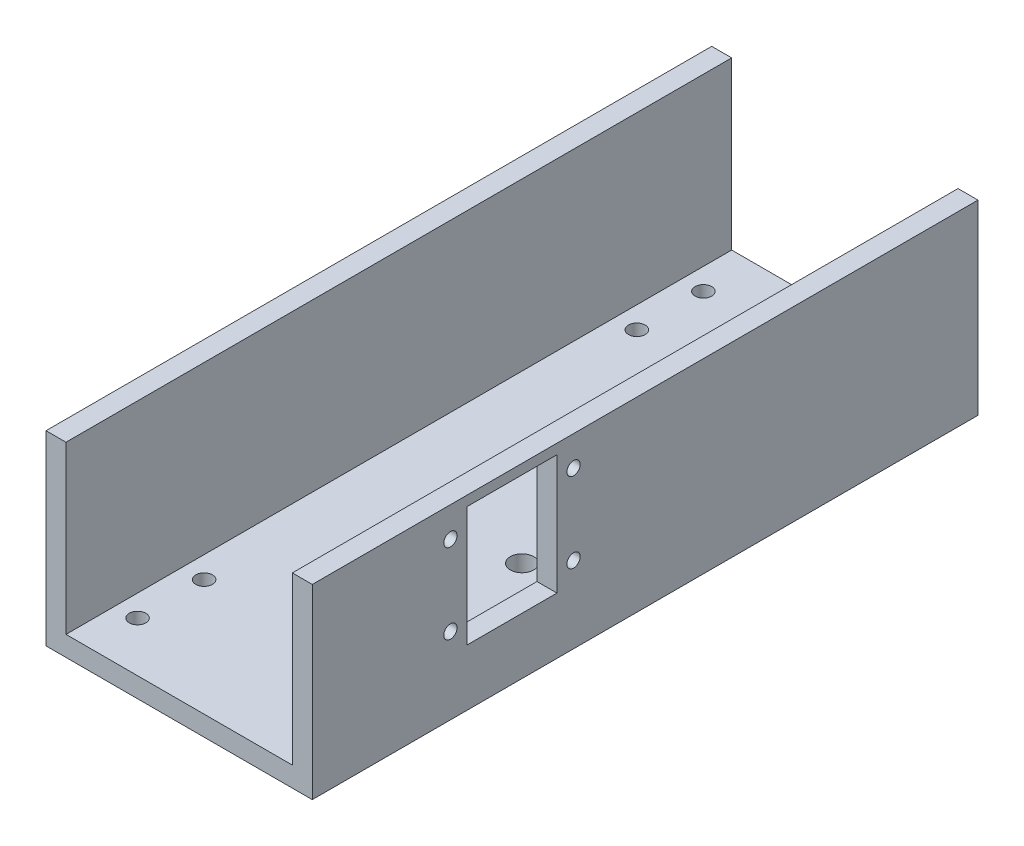
ISO-10303-21;
HEADER;
FILE_DESCRIPTION(('STEP AP214'),'2;1');
FILE_NAME('part.step','',(''),(''),'','','');
FILE_SCHEMA(('AUTOMOTIVE_DESIGN { 1 0 10303 214 1 1 1 1 }'));
ENDSEC;
DATA;
#1=APPLICATION_CONTEXT('core data for automotive mechanical design processes');
#2=APPLICATION_PROTOCOL_DEFINITION('international standard','automotive_design',2000,#1);
#3=PRODUCT_CONTEXT('',#1,'mechanical');
#4=PRODUCT('Part','Part','',(#3));
#5=PRODUCT_RELATED_PRODUCT_CATEGORY('part','',(#4));
#6=PRODUCT_DEFINITION_FORMATION('','',#4);
#7=PRODUCT_DEFINITION_CONTEXT('part definition',#1,'design');
#8=PRODUCT_DEFINITION('design','',#6,#7);
#9=PRODUCT_DEFINITION_SHAPE('','',#8);
#10=(LENGTH_UNIT() NAMED_UNIT(*) SI_UNIT(.MILLI.,.METRE.));
#11=(NAMED_UNIT(*) PLANE_ANGLE_UNIT() SI_UNIT($,.RADIAN.));
#12=(NAMED_UNIT(*) SI_UNIT($,.STERADIAN.) SOLID_ANGLE_UNIT());
#13=UNCERTAINTY_MEASURE_WITH_UNIT(LENGTH_MEASURE(1.E-05),#10,'distance_accuracy_value','');
#14=(GEOMETRIC_REPRESENTATION_CONTEXT(3) GLOBAL_UNCERTAINTY_ASSIGNED_CONTEXT((#13)) GLOBAL_UNIT_ASSIGNED_CONTEXT((#10,
#11,#12)) REPRESENTATION_CONTEXT('',''));
#15=CARTESIAN_POINT('',(0.,0.,0.));
#16=DIRECTION('',(0.,0.,1.));
#17=DIRECTION('',(1.,0.,0.));
#18=AXIS2_PLACEMENT_3D('',#15,#16,#17);
#19=CARTESIAN_POINT('',(40.,56.,200.));
#20=DIRECTION('',(0.,-1.,0.));
#21=DIRECTION('',(0.,0.,-1.));
#22=AXIS2_PLACEMENT_3D('',#19,#20,#21);
#23=PLANE('',#22);
#24=DIRECTION('',(-1.,0.,0.));
#25=VECTOR('',#24,1.);
#26=CARTESIAN_POINT('',(40.,56.,0.));
#27=LINE('',#26,#25);
#28=CARTESIAN_POINT('',(40.,56.,0.));
#29=VERTEX_POINT('',#28);
#30=CARTESIAN_POINT('',(34.,56.,0.));
#31=VERTEX_POINT('',#30);
#32=EDGE_CURVE('E204',#29,#31,#27,.T.);
#33=ORIENTED_EDGE('',*,*,#32,.T.);
#34=DIRECTION('',(0.,0.,-1.));
#35=VECTOR('',#34,1.);
#36=CARTESIAN_POINT('',(34.,56.,200.));
#37=LINE('',#36,#35);
#38=CARTESIAN_POINT('',(34.,56.,200.));
#39=VERTEX_POINT('',#38);
#40=EDGE_CURVE('E11',#39,#31,#37,.T.);
#41=ORIENTED_EDGE('',*,*,#40,.F.);
#42=DIRECTION('',(-1.,0.,0.));
#43=VECTOR('',#42,1.);
#44=CARTESIAN_POINT('',(40.,56.,200.));
#45=LINE('',#44,#43);
#46=CARTESIAN_POINT('',(40.,56.,200.));
#47=VERTEX_POINT('',#46);
#48=EDGE_CURVE('E205',#47,#39,#45,.T.);
#49=ORIENTED_EDGE('',*,*,#48,.F.);
#50=DIRECTION('',(0.,0.,-1.));
#51=VECTOR('',#50,1.);
#52=CARTESIAN_POINT('',(40.,56.,200.));
#53=LINE('',#52,#51);
#54=EDGE_CURVE('E223',#47,#29,#53,.T.);
#55=ORIENTED_EDGE('',*,*,#54,.T.);
#56=EDGE_LOOP('',(#33,#41,#49,#55));
#57=FACE_BOUND('',#56,.T.);
#58=ADVANCED_FACE('F35',(#57),#23,.F.);
#59=CARTESIAN_POINT('',(34.,56.,200.));
#60=DIRECTION('',(1.,0.,0.));
#61=DIRECTION('',(0.,1.,0.));
#62=AXIS2_PLACEMENT_3D('',#59,#60,#61);
#63=PLANE('',#62);
#64=CARTESIAN_POINT('',(34.,23.0000000004471,158.5));
#65=DIRECTION('',(1.,0.,0.));
#66=DIRECTION('',(0.,1.,0.));
#67=AXIS2_PLACEMENT_3D('',#64,#65,#66);
#68=CIRCLE('',#67,2.);
#69=CARTESIAN_POINT('',(34.,25.0000000004471,158.5));
#70=VERTEX_POINT('',#69);
#71=EDGE_CURVE('E264',#70,#70,#68,.T.);
#72=ORIENTED_EDGE('',*,*,#71,.T.);
#73=EDGE_LOOP('',(#72));
#74=FACE_BOUND('',#73,.T.);
#75=CARTESIAN_POINT('',(34.,47.0000000004471,158.5));
#76=DIRECTION('',(1.,0.,0.));
#77=DIRECTION('',(0.,1.,0.));
#78=AXIS2_PLACEMENT_3D('',#75,#76,#77);
#79=CIRCLE('',#78,1.99999999998778);
#80=CARTESIAN_POINT('',(34.,49.0000000004349,158.5));
#81=VERTEX_POINT('',#80);
#82=EDGE_CURVE('E279',#81,#81,#79,.T.);
#83=ORIENTED_EDGE('',*,*,#82,.T.);
#84=EDGE_LOOP('',(#83));
#85=FACE_BOUND('',#84,.T.);
#86=CARTESIAN_POINT('',(34.,47.0000000004471,121.5));
#87=DIRECTION('',(1.,0.,0.));
#88=DIRECTION('',(0.,1.,0.));
#89=AXIS2_PLACEMENT_3D('',#86,#87,#88);
#90=CIRCLE('',#89,1.99999999998778);
#91=CARTESIAN_POINT('',(34.,49.0000000004349,121.5));
#92=VERTEX_POINT('',#91);
#93=EDGE_CURVE('E285',#92,#92,#90,.T.);
#94=ORIENTED_EDGE('',*,*,#93,.T.);
#95=EDGE_LOOP('',(#94));
#96=FACE_BOUND('',#95,.T.);
#97=CARTESIAN_POINT('',(34.,23.0000000004471,121.5));
#98=DIRECTION('',(1.,0.,0.));
#99=DIRECTION('',(0.,1.,0.));
#100=AXIS2_PLACEMENT_3D('',#97,#98,#99);
#101=CIRCLE('',#100,2.);
#102=CARTESIAN_POINT('',(34.,25.0000000004471,121.5));
#103=VERTEX_POINT('',#102);
#104=EDGE_CURVE('E291',#103,#103,#101,.T.);
#105=ORIENTED_EDGE('',*,*,#104,.T.);
#106=EDGE_LOOP('',(#105));
#107=FACE_BOUND('',#106,.T.);
#108=DIRECTION('',(0.,0.,-1.));
#109=VECTOR('',#108,1.);
#110=CARTESIAN_POINT('',(34.,17.0000000004471,200.));
#111=LINE('',#110,#109);
#112=CARTESIAN_POINT('',(34.,17.0000000004471,153.5));
#113=VERTEX_POINT('',#112);
#114=CARTESIAN_POINT('',(34.,17.0000000004471,126.5));
#115=VERTEX_POINT('',#114);
#116=EDGE_CURVE('E156',#113,#115,#111,.T.);
#117=ORIENTED_EDGE('',*,*,#116,.T.);
#118=DIRECTION('',(0.,1.,0.));
#119=VECTOR('',#118,1.);
#120=CARTESIAN_POINT('',(34.,56.,126.5));
#121=LINE('',#120,#119);
#122=CARTESIAN_POINT('',(34.,53.0000000004471,126.5));
#123=VERTEX_POINT('',#122);
#124=EDGE_CURVE('E159',#115,#123,#121,.T.);
#125=ORIENTED_EDGE('',*,*,#124,.T.);
#126=DIRECTION('',(0.,0.,1.));
#127=VECTOR('',#126,1.);
#128=CARTESIAN_POINT('',(34.,53.0000000004471,200.));
#129=LINE('',#128,#127);
#130=CARTESIAN_POINT('',(34.,53.0000000004471,153.5));
#131=VERTEX_POINT('',#130);
#132=EDGE_CURVE('E151',#123,#131,#129,.T.);
#133=ORIENTED_EDGE('',*,*,#132,.T.);
#134=DIRECTION('',(0.,-1.,0.));
#135=VECTOR('',#134,1.);
#136=CARTESIAN_POINT('',(34.,56.,153.5));
#137=LINE('',#136,#135);
#138=EDGE_CURVE('E131',#131,#113,#137,.T.);
#139=ORIENTED_EDGE('',*,*,#138,.T.);
#140=EDGE_LOOP('',(#117,#125,#133,#139));
#141=FACE_BOUND('',#140,.T.);
#142=DIRECTION('',(0.,-1.,0.));
#143=VECTOR('',#142,1.);
#144=CARTESIAN_POINT('',(34.,56.,0.));
#145=LINE('',#144,#143);
#146=CARTESIAN_POINT('',(34.,5.99999999999999,0.));
#147=VERTEX_POINT('',#146);
#148=EDGE_CURVE('E226',#31,#147,#145,.T.);
#149=ORIENTED_EDGE('',*,*,#148,.T.);
#150=DIRECTION('',(0.,0.,-1.));
#151=VECTOR('',#150,1.);
#152=CARTESIAN_POINT('',(34.,5.99999999999999,200.));
#153=LINE('',#152,#151);
#154=CARTESIAN_POINT('',(34.,5.99999999999999,200.));
#155=VERTEX_POINT('',#154);
#156=EDGE_CURVE('E43',#155,#147,#153,.T.);
#157=ORIENTED_EDGE('',*,*,#156,.F.);
#158=DIRECTION('',(0.,-1.,0.));
#159=VECTOR('',#158,1.);
#160=CARTESIAN_POINT('',(34.,56.,200.));
#161=LINE('',#160,#159);
#162=EDGE_CURVE('E208',#39,#155,#161,.T.);
#163=ORIENTED_EDGE('',*,*,#162,.F.);
#164=ORIENTED_EDGE('',*,*,#40,.T.);
#165=EDGE_LOOP('',(#149,#157,#163,#164));
#166=FACE_BOUND('',#165,.T.);
#167=ADVANCED_FACE('F295',(#74,#85,#96,#107,#141,#166),#63,.F.);
#168=CARTESIAN_POINT('',(34.,5.99999999999999,200.));
#169=DIRECTION('',(0.,-1.,0.));
#170=DIRECTION('',(0.,0.,-1.));
#171=AXIS2_PLACEMENT_3D('',#168,#169,#170);
#172=PLANE('',#171);
#173=CARTESIAN_POINT('',(15.9999999977947,5.99999999999999,113.000000000013));
#174=DIRECTION('',(0.,1.,0.));
#175=DIRECTION('',(0.,0.,1.));
#176=AXIS2_PLACEMENT_3D('',#173,#174,#175);
#177=CIRCLE('',#176,3.5000000021011);
#178=CARTESIAN_POINT('',(15.9999999977947,5.99999999999999,116.500000002114));
#179=VERTEX_POINT('',#178);
#180=EDGE_CURVE('E271',#179,#179,#177,.T.);
#181=ORIENTED_EDGE('',*,*,#180,.F.);
#182=EDGE_LOOP('',(#181));
#183=FACE_BOUND('',#182,.T.);
#184=CARTESIAN_POINT('',(15.9999999977947,5.99999999999999,166.000000000012));
#185=DIRECTION('',(0.,1.,0.));
#186=DIRECTION('',(0.,0.,1.));
#187=AXIS2_PLACEMENT_3D('',#184,#185,#186);
#188=CIRCLE('',#187,3.5);
#189=CARTESIAN_POINT('',(15.9999999977947,5.99999999999999,169.500000000012));
#190=VERTEX_POINT('',#189);
#191=EDGE_CURVE('E260',#190,#190,#188,.T.);
#192=ORIENTED_EDGE('',*,*,#191,.F.);
#193=EDGE_LOOP('',(#192));
#194=FACE_BOUND('',#193,.T.);
#195=CARTESIAN_POINT('',(-27.5,5.99999999999999,15.));
#196=DIRECTION('',(0.,-1.,0.));
#197=DIRECTION('',(0.,0.,-1.));
#198=AXIS2_PLACEMENT_3D('',#195,#196,#197);
#199=CIRCLE('',#198,2.49999999999999);
#200=CARTESIAN_POINT('',(-27.5,5.99999999999999,12.5));
#201=VERTEX_POINT('',#200);
#202=EDGE_CURVE('E165',#201,#201,#199,.F.);
#203=ORIENTED_EDGE('',*,*,#202,.F.);
#204=EDGE_LOOP('',(#203));
#205=FACE_BOUND('',#204,.T.);
#206=CARTESIAN_POINT('',(27.5,5.99999999999999,15.));
#207=DIRECTION('',(0.,-1.,0.));
#208=DIRECTION('',(0.,0.,-1.));
#209=AXIS2_PLACEMENT_3D('',#206,#207,#208);
#210=CIRCLE('',#209,2.49999999999999);
#211=CARTESIAN_POINT('',(27.5,5.99999999999999,12.5));
#212=VERTEX_POINT('',#211);
#213=EDGE_CURVE('E171',#212,#212,#210,.F.);
#214=ORIENTED_EDGE('',*,*,#213,.F.);
#215=EDGE_LOOP('',(#214));
#216=FACE_BOUND('',#215,.T.);
#217=CARTESIAN_POINT('',(-27.5,5.99999999999999,35.));
#218=DIRECTION('',(0.,-1.,0.));
#219=DIRECTION('',(0.,0.,-1.));
#220=AXIS2_PLACEMENT_3D('',#217,#218,#219);
#221=CIRCLE('',#220,2.50000000000001);
#222=CARTESIAN_POINT('',(-27.5,5.99999999999999,32.5));
#223=VERTEX_POINT('',#222);
#224=EDGE_CURVE('E177',#223,#223,#221,.F.);
#225=ORIENTED_EDGE('',*,*,#224,.F.);
#226=EDGE_LOOP('',(#225));
#227=FACE_BOUND('',#226,.T.);
#228=CARTESIAN_POINT('',(27.5,5.99999999999999,35.));
#229=DIRECTION('',(0.,-1.,0.));
#230=DIRECTION('',(0.,0.,-1.));
#231=AXIS2_PLACEMENT_3D('',#228,#229,#230);
#232=CIRCLE('',#231,2.50000000000001);
#233=CARTESIAN_POINT('',(27.5,5.99999999999999,32.5));
#234=VERTEX_POINT('',#233);
#235=EDGE_CURVE('E183',#234,#234,#232,.F.);
#236=ORIENTED_EDGE('',*,*,#235,.F.);
#237=EDGE_LOOP('',(#236));
#238=FACE_BOUND('',#237,.T.);
#239=CARTESIAN_POINT('',(-27.5,5.99999999999999,165.));
#240=DIRECTION('',(0.,-1.,0.));
#241=DIRECTION('',(0.,0.,-1.));
#242=AXIS2_PLACEMENT_3D('',#239,#240,#241);
#243=CIRCLE('',#242,2.50000000000001);
#244=CARTESIAN_POINT('',(-27.5,5.99999999999999,162.5));
#245=VERTEX_POINT('',#244);
#246=EDGE_CURVE('E189',#245,#245,#243,.F.);
#247=ORIENTED_EDGE('',*,*,#246,.F.);
#248=EDGE_LOOP('',(#247));
#249=FACE_BOUND('',#248,.T.);
#250=CARTESIAN_POINT('',(27.5,5.99999999999999,185.));
#251=DIRECTION('',(0.,-1.,0.));
#252=DIRECTION('',(0.,0.,-1.));
#253=AXIS2_PLACEMENT_3D('',#250,#251,#252);
#254=CIRCLE('',#253,2.5);
#255=CARTESIAN_POINT('',(27.5,5.99999999999999,182.5));
#256=VERTEX_POINT('',#255);
#257=EDGE_CURVE('E195',#256,#256,#254,.F.);
#258=ORIENTED_EDGE('',*,*,#257,.F.);
#259=EDGE_LOOP('',(#258));
#260=FACE_BOUND('',#259,.T.);
#261=CARTESIAN_POINT('',(-27.5,5.99999999999999,185.));
#262=DIRECTION('',(0.,-1.,0.));
#263=DIRECTION('',(0.,0.,-1.));
#264=AXIS2_PLACEMENT_3D('',#261,#262,#263);
#265=CIRCLE('',#264,2.5);
#266=CARTESIAN_POINT('',(-27.5,5.99999999999999,182.5));
#267=VERTEX_POINT('',#266);
#268=EDGE_CURVE('E201',#267,#267,#265,.F.);
#269=ORIENTED_EDGE('',*,*,#268,.F.);
#270=EDGE_LOOP('',(#269));
#271=FACE_BOUND('',#270,.T.);
#272=DIRECTION('',(-1.,0.,0.));
#273=VECTOR('',#272,1.);
#274=CARTESIAN_POINT('',(34.,5.99999999999999,0.));
#275=LINE('',#274,#273);
#276=CARTESIAN_POINT('',(-34.,5.99999999999999,0.));
#277=VERTEX_POINT('',#276);
#278=EDGE_CURVE('E228',#147,#277,#275,.T.);
#279=ORIENTED_EDGE('',*,*,#278,.T.);
#280=DIRECTION('',(0.,0.,-1.));
#281=VECTOR('',#280,1.);
#282=CARTESIAN_POINT('',(-34.,5.99999999999999,200.));
#283=LINE('',#282,#281);
#284=CARTESIAN_POINT('',(-34.,5.99999999999999,200.));
#285=VERTEX_POINT('',#284);
#286=EDGE_CURVE('E253',#285,#277,#283,.T.);
#287=ORIENTED_EDGE('',*,*,#286,.F.);
#288=DIRECTION('',(-1.,0.,0.));
#289=VECTOR('',#288,1.);
#290=CARTESIAN_POINT('',(34.,5.99999999999999,200.));
#291=LINE('',#290,#289);
#292=EDGE_CURVE('E211',#155,#285,#291,.T.);
#293=ORIENTED_EDGE('',*,*,#292,.F.);
#294=ORIENTED_EDGE('',*,*,#156,.T.);
#295=EDGE_LOOP('',(#279,#287,#293,#294));
#296=FACE_BOUND('',#295,.T.);
#297=ADVANCED_FACE('F317',(#183,#194,#205,#216,#227,#238,#249,#260,#271,#296),#172,.F.);
#298=CARTESIAN_POINT('',(-34.,56.,200.));
#299=DIRECTION('',(-1.,0.,0.));
#300=DIRECTION('',(0.,-1.,0.));
#301=AXIS2_PLACEMENT_3D('',#298,#299,#300);
#302=PLANE('',#301);
#303=DIRECTION('',(0.,1.,0.));
#304=VECTOR('',#303,1.);
#305=CARTESIAN_POINT('',(-34.,56.,0.));
#306=LINE('',#305,#304);
#307=CARTESIAN_POINT('',(-34.,56.,0.));
#308=VERTEX_POINT('',#307);
#309=EDGE_CURVE('E230',#277,#308,#306,.T.);
#310=ORIENTED_EDGE('',*,*,#309,.T.);
#311=DIRECTION('',(0.,0.,-1.));
#312=VECTOR('',#311,1.);
#313=CARTESIAN_POINT('',(-34.,56.,200.));
#314=LINE('',#313,#312);
#315=CARTESIAN_POINT('',(-34.,56.,200.));
#316=VERTEX_POINT('',#315);
#317=EDGE_CURVE('E250',#316,#308,#314,.T.);
#318=ORIENTED_EDGE('',*,*,#317,.F.);
#319=DIRECTION('',(0.,1.,0.));
#320=VECTOR('',#319,1.);
#321=CARTESIAN_POINT('',(-34.,56.,200.));
#322=LINE('',#321,#320);
#323=EDGE_CURVE('E213',#285,#316,#322,.T.);
#324=ORIENTED_EDGE('',*,*,#323,.F.);
#325=ORIENTED_EDGE('',*,*,#286,.T.);
#326=EDGE_LOOP('',(#310,#318,#324,#325));
#327=FACE_BOUND('',#326,.T.);
#328=ADVANCED_FACE('F352',(#327),#302,.F.);
#329=CARTESIAN_POINT('',(-40.,56.,200.));
#330=DIRECTION('',(0.,-1.,0.));
#331=DIRECTION('',(0.,0.,-1.));
#332=AXIS2_PLACEMENT_3D('',#329,#330,#331);
#333=PLANE('',#332);
#334=DIRECTION('',(-1.,0.,0.));
#335=VECTOR('',#334,1.);
#336=CARTESIAN_POINT('',(-40.,56.,0.));
#337=LINE('',#336,#335);
#338=CARTESIAN_POINT('',(-40.,56.,0.));
#339=VERTEX_POINT('',#338);
#340=EDGE_CURVE('E232',#308,#339,#337,.T.);
#341=ORIENTED_EDGE('',*,*,#340,.T.);
#342=DIRECTION('',(0.,0.,-1.));
#343=VECTOR('',#342,1.);
#344=CARTESIAN_POINT('',(-40.,56.,200.));
#345=LINE('',#344,#343);
#346=CARTESIAN_POINT('',(-40.,56.,200.));
#347=VERTEX_POINT('',#346);
#348=EDGE_CURVE('E247',#347,#339,#345,.T.);
#349=ORIENTED_EDGE('',*,*,#348,.F.);
#350=DIRECTION('',(-1.,0.,0.));
#351=VECTOR('',#350,1.);
#352=CARTESIAN_POINT('',(-40.,56.,200.));
#353=LINE('',#352,#351);
#354=EDGE_CURVE('E215',#316,#347,#353,.T.);
#355=ORIENTED_EDGE('',*,*,#354,.F.);
#356=ORIENTED_EDGE('',*,*,#317,.T.);
#357=EDGE_LOOP('',(#341,#349,#355,#356));
#358=FACE_BOUND('',#357,.T.);
#359=ADVANCED_FACE('F348',(#358),#333,.F.);
#360=CARTESIAN_POINT('',(-40.,0.,200.));
#361=DIRECTION('',(1.,0.,0.));
#362=DIRECTION('',(0.,0.,-1.));
#363=AXIS2_PLACEMENT_3D('',#360,#361,#362);
#364=PLANE('',#363);
#365=DIRECTION('',(0.,-1.,0.));
#366=VECTOR('',#365,1.);
#367=CARTESIAN_POINT('',(-40.,0.,0.));
#368=LINE('',#367,#366);
#369=CARTESIAN_POINT('',(-40.,0.,0.));
#370=VERTEX_POINT('',#369);
#371=EDGE_CURVE('E234',#339,#370,#368,.T.);
#372=ORIENTED_EDGE('',*,*,#371,.T.);
#373=DIRECTION('',(0.,0.,-1.));
#374=VECTOR('',#373,1.);
#375=CARTESIAN_POINT('',(-40.,0.,200.));
#376=LINE('',#375,#374);
#377=CARTESIAN_POINT('',(-40.,0.,200.));
#378=VERTEX_POINT('',#377);
#379=EDGE_CURVE('E244',#378,#370,#376,.T.);
#380=ORIENTED_EDGE('',*,*,#379,.F.);
#381=DIRECTION('',(0.,-1.,0.));
#382=VECTOR('',#381,1.);
#383=CARTESIAN_POINT('',(-40.,0.,200.));
#384=LINE('',#383,#382);
#385=EDGE_CURVE('E217',#347,#378,#384,.T.);
#386=ORIENTED_EDGE('',*,*,#385,.F.);
#387=ORIENTED_EDGE('',*,*,#348,.T.);
#388=EDGE_LOOP('',(#372,#380,#386,#387));
#389=FACE_BOUND('',#388,.T.);
#390=ADVANCED_FACE('F343',(#389),#364,.F.);
#391=CARTESIAN_POINT('',(-40.,0.,200.));
#392=DIRECTION('',(0.,1.,0.));
#393=DIRECTION('',(0.,0.,1.));
#394=AXIS2_PLACEMENT_3D('',#391,#392,#393);
#395=PLANE('',#394);
#396=CARTESIAN_POINT('',(15.9999999977947,0.,113.000000000013));
#397=DIRECTION('',(0.,1.,0.));
#398=DIRECTION('',(0.,0.,1.));
#399=AXIS2_PLACEMENT_3D('',#396,#397,#398);
#400=CIRCLE('',#399,3.5000000021011);
#401=CARTESIAN_POINT('',(15.9999999977947,0.,116.500000002114));
#402=VERTEX_POINT('',#401);
#403=EDGE_CURVE('E38',#402,#402,#400,.T.);
#404=ORIENTED_EDGE('',*,*,#403,.T.);
#405=EDGE_LOOP('',(#404));
#406=FACE_BOUND('',#405,.T.);
#407=CARTESIAN_POINT('',(15.9999999977947,0.,166.000000000012));
#408=DIRECTION('',(0.,1.,0.));
#409=DIRECTION('',(0.,0.,1.));
#410=AXIS2_PLACEMENT_3D('',#407,#408,#409);
#411=CIRCLE('',#410,3.5);
#412=CARTESIAN_POINT('',(15.9999999977947,0.,169.500000000012));
#413=VERTEX_POINT('',#412);
#414=EDGE_CURVE('E257',#413,#413,#411,.T.);
#415=ORIENTED_EDGE('',*,*,#414,.T.);
#416=EDGE_LOOP('',(#415));
#417=FACE_BOUND('',#416,.T.);
#418=CARTESIAN_POINT('',(-27.5,0.,15.));
#419=DIRECTION('',(0.,-1.,0.));
#420=DIRECTION('',(0.,0.,1.));
#421=AXIS2_PLACEMENT_3D('',#418,#419,#420);
#422=CIRCLE('',#421,2.49999999999999);
#423=CARTESIAN_POINT('',(-27.5,0.,17.5));
#424=VERTEX_POINT('',#423);
#425=EDGE_CURVE('E162',#424,#424,#422,.T.);
#426=ORIENTED_EDGE('',*,*,#425,.F.);
#427=EDGE_LOOP('',(#426));
#428=FACE_BOUND('',#427,.T.);
#429=CARTESIAN_POINT('',(27.5,0.,15.));
#430=DIRECTION('',(0.,-1.,0.));
#431=DIRECTION('',(0.,0.,1.));
#432=AXIS2_PLACEMENT_3D('',#429,#430,#431);
#433=CIRCLE('',#432,2.49999999999999);
#434=CARTESIAN_POINT('',(27.5,0.,17.5));
#435=VERTEX_POINT('',#434);
#436=EDGE_CURVE('E168',#435,#435,#433,.T.);
#437=ORIENTED_EDGE('',*,*,#436,.F.);
#438=EDGE_LOOP('',(#437));
#439=FACE_BOUND('',#438,.T.);
#440=CARTESIAN_POINT('',(-27.5,0.,35.));
#441=DIRECTION('',(0.,-1.,0.));
#442=DIRECTION('',(0.,0.,1.));
#443=AXIS2_PLACEMENT_3D('',#440,#441,#442);
#444=CIRCLE('',#443,2.50000000000001);
#445=CARTESIAN_POINT('',(-27.5,0.,37.5));
#446=VERTEX_POINT('',#445);
#447=EDGE_CURVE('E174',#446,#446,#444,.T.);
#448=ORIENTED_EDGE('',*,*,#447,.F.);
#449=EDGE_LOOP('',(#448));
#450=FACE_BOUND('',#449,.T.);
#451=CARTESIAN_POINT('',(27.5,0.,35.));
#452=DIRECTION('',(0.,-1.,0.));
#453=DIRECTION('',(0.,0.,1.));
#454=AXIS2_PLACEMENT_3D('',#451,#452,#453);
#455=CIRCLE('',#454,2.50000000000001);
#456=CARTESIAN_POINT('',(27.5,0.,37.5));
#457=VERTEX_POINT('',#456);
#458=EDGE_CURVE('E180',#457,#457,#455,.T.);
#459=ORIENTED_EDGE('',*,*,#458,.F.);
#460=EDGE_LOOP('',(#459));
#461=FACE_BOUND('',#460,.T.);
#462=CARTESIAN_POINT('',(-27.5,0.,165.));
#463=DIRECTION('',(0.,-1.,0.));
#464=DIRECTION('',(0.,0.,-1.));
#465=AXIS2_PLACEMENT_3D('',#462,#463,#464);
#466=CIRCLE('',#465,2.50000000000001);
#467=CARTESIAN_POINT('',(-27.5,0.,162.5));
#468=VERTEX_POINT('',#467);
#469=EDGE_CURVE('E186',#468,#468,#466,.T.);
#470=ORIENTED_EDGE('',*,*,#469,.F.);
#471=EDGE_LOOP('',(#470));
#472=FACE_BOUND('',#471,.T.);
#473=CARTESIAN_POINT('',(27.5,0.,185.));
#474=DIRECTION('',(0.,-1.,0.));
#475=DIRECTION('',(0.,0.,-1.));
#476=AXIS2_PLACEMENT_3D('',#473,#474,#475);
#477=CIRCLE('',#476,2.5);
#478=CARTESIAN_POINT('',(27.5,0.,182.5));
#479=VERTEX_POINT('',#478);
#480=EDGE_CURVE('E192',#479,#479,#477,.T.);
#481=ORIENTED_EDGE('',*,*,#480,.F.);
#482=EDGE_LOOP('',(#481));
#483=FACE_BOUND('',#482,.T.);
#484=CARTESIAN_POINT('',(-27.5,0.,185.));
#485=DIRECTION('',(0.,-1.,0.));
#486=DIRECTION('',(0.,0.,-1.));
#487=AXIS2_PLACEMENT_3D('',#484,#485,#486);
#488=CIRCLE('',#487,2.5);
#489=CARTESIAN_POINT('',(-27.5,0.,182.5));
#490=VERTEX_POINT('',#489);
#491=EDGE_CURVE('E198',#490,#490,#488,.T.);
#492=ORIENTED_EDGE('',*,*,#491,.F.);
#493=EDGE_LOOP('',(#492));
#494=FACE_BOUND('',#493,.T.);
#495=DIRECTION('',(1.,0.,0.));
#496=VECTOR('',#495,1.);
#497=CARTESIAN_POINT('',(-40.,0.,0.));
#498=LINE('',#497,#496);
#499=CARTESIAN_POINT('',(40.,0.,0.));
#500=VERTEX_POINT('',#499);
#501=EDGE_CURVE('E236',#370,#500,#498,.T.);
#502=ORIENTED_EDGE('',*,*,#501,.T.);
#503=DIRECTION('',(0.,0.,-1.));
#504=VECTOR('',#503,1.);
#505=CARTESIAN_POINT('',(40.,0.,200.));
#506=LINE('',#505,#504);
#507=CARTESIAN_POINT('',(40.,0.,200.));
#508=VERTEX_POINT('',#507);
#509=EDGE_CURVE('E241',#508,#500,#506,.T.);
#510=ORIENTED_EDGE('',*,*,#509,.F.);
#511=DIRECTION('',(1.,0.,0.));
#512=VECTOR('',#511,1.);
#513=CARTESIAN_POINT('',(-40.,0.,200.));
#514=LINE('',#513,#512);
#515=EDGE_CURVE('E219',#378,#508,#514,.T.);
#516=ORIENTED_EDGE('',*,*,#515,.F.);
#517=ORIENTED_EDGE('',*,*,#379,.T.);
#518=EDGE_LOOP('',(#502,#510,#516,#517));
#519=FACE_BOUND('',#518,.T.);
#520=ADVANCED_FACE('F338',(#406,#417,#428,#439,#450,#461,#472,#483,#494,#519),#395,.F.);
#521=CARTESIAN_POINT('',(40.,0.,200.));
#522=DIRECTION('',(-1.,0.,0.));
#523=DIRECTION('',(0.,0.,1.));
#524=AXIS2_PLACEMENT_3D('',#521,#522,#523);
#525=PLANE('',#524);
#526=CARTESIAN_POINT('',(40.,23.0000000004471,158.5));
#527=DIRECTION('',(1.,0.,0.));
#528=DIRECTION('',(0.,0.,-1.));
#529=AXIS2_PLACEMENT_3D('',#526,#527,#528);
#530=CIRCLE('',#529,2.);
#531=CARTESIAN_POINT('',(40.,23.0000000004471,156.5));
#532=VERTEX_POINT('',#531);
#533=EDGE_CURVE('E259',#532,#532,#530,.T.);
#534=ORIENTED_EDGE('',*,*,#533,.F.);
#535=EDGE_LOOP('',(#534));
#536=FACE_BOUND('',#535,.T.);
#537=CARTESIAN_POINT('',(40.,47.0000000004471,158.5));
#538=DIRECTION('',(1.,0.,0.));
#539=DIRECTION('',(0.,0.,-1.));
#540=AXIS2_PLACEMENT_3D('',#537,#538,#539);
#541=CIRCLE('',#540,1.99999999998778);
#542=CARTESIAN_POINT('',(40.,47.0000000004471,156.500000000012));
#543=VERTEX_POINT('',#542);
#544=EDGE_CURVE('E276',#543,#543,#541,.T.);
#545=ORIENTED_EDGE('',*,*,#544,.F.);
#546=EDGE_LOOP('',(#545));
#547=FACE_BOUND('',#546,.T.);
#548=CARTESIAN_POINT('',(40.,47.0000000004471,121.5));
#549=DIRECTION('',(1.,0.,0.));
#550=DIRECTION('',(0.,0.,1.));
#551=AXIS2_PLACEMENT_3D('',#548,#549,#550);
#552=CIRCLE('',#551,1.99999999998778);
#553=CARTESIAN_POINT('',(40.,47.0000000004471,123.499999999988));
#554=VERTEX_POINT('',#553);
#555=EDGE_CURVE('E282',#554,#554,#552,.T.);
#556=ORIENTED_EDGE('',*,*,#555,.F.);
#557=EDGE_LOOP('',(#556));
#558=FACE_BOUND('',#557,.T.);
#559=CARTESIAN_POINT('',(40.,23.0000000004471,121.5));
#560=DIRECTION('',(1.,0.,0.));
#561=DIRECTION('',(0.,0.,1.));
#562=AXIS2_PLACEMENT_3D('',#559,#560,#561);
#563=CIRCLE('',#562,2.);
#564=CARTESIAN_POINT('',(40.,23.0000000004471,123.5));
#565=VERTEX_POINT('',#564);
#566=EDGE_CURVE('E288',#565,#565,#563,.T.);
#567=ORIENTED_EDGE('',*,*,#566,.F.);
#568=EDGE_LOOP('',(#567));
#569=FACE_BOUND('',#568,.T.);
#570=DIRECTION('',(0.,0.,1.));
#571=VECTOR('',#570,1.);
#572=CARTESIAN_POINT('',(40.,53.0000000004471,126.5));
#573=LINE('',#572,#571);
#574=CARTESIAN_POINT('',(40.,53.0000000004471,126.5));
#575=VERTEX_POINT('',#574);
#576=CARTESIAN_POINT('',(40.,53.0000000004471,153.5));
#577=VERTEX_POINT('',#576);
#578=EDGE_CURVE('E137',#575,#577,#573,.T.);
#579=ORIENTED_EDGE('',*,*,#578,.F.);
#580=DIRECTION('',(0.,1.,0.));
#581=VECTOR('',#580,1.);
#582=CARTESIAN_POINT('',(40.,17.0000000004471,126.5));
#583=LINE('',#582,#581);
#584=CARTESIAN_POINT('',(40.,17.0000000004471,126.5));
#585=VERTEX_POINT('',#584);
#586=EDGE_CURVE('E59',#585,#575,#583,.T.);
#587=ORIENTED_EDGE('',*,*,#586,.F.);
#588=DIRECTION('',(0.,0.,-1.));
#589=VECTOR('',#588,1.);
#590=CARTESIAN_POINT('',(40.,17.0000000004471,126.5));
#591=LINE('',#590,#589);
#592=CARTESIAN_POINT('',(40.,17.0000000004471,153.5));
#593=VERTEX_POINT('',#592);
#594=EDGE_CURVE('E144',#593,#585,#591,.T.);
#595=ORIENTED_EDGE('',*,*,#594,.F.);
#596=DIRECTION('',(0.,-1.,0.));
#597=VECTOR('',#596,1.);
#598=CARTESIAN_POINT('',(40.,17.0000000004471,153.5));
#599=LINE('',#598,#597);
#600=EDGE_CURVE('E128',#577,#593,#599,.T.);
#601=ORIENTED_EDGE('',*,*,#600,.F.);
#602=EDGE_LOOP('',(#579,#587,#595,#601));
#603=FACE_BOUND('',#602,.T.);
#604=DIRECTION('',(0.,1.,0.));
#605=VECTOR('',#604,1.);
#606=CARTESIAN_POINT('',(40.,0.,0.));
#607=LINE('',#606,#605);
#608=EDGE_CURVE('E209',#500,#29,#607,.T.);
#609=ORIENTED_EDGE('',*,*,#608,.T.);
#610=ORIENTED_EDGE('',*,*,#54,.F.);
#611=DIRECTION('',(0.,1.,0.));
#612=VECTOR('',#611,1.);
#613=CARTESIAN_POINT('',(40.,0.,200.));
#614=LINE('',#613,#612);
#615=EDGE_CURVE('E221',#508,#47,#614,.T.);
#616=ORIENTED_EDGE('',*,*,#615,.F.);
#617=ORIENTED_EDGE('',*,*,#509,.T.);
#618=EDGE_LOOP('',(#609,#610,#616,#617));
#619=FACE_BOUND('',#618,.T.);
#620=ADVANCED_FACE('F141',(#536,#547,#558,#569,#603,#619),#525,.F.);
#621=CARTESIAN_POINT('',(0.,0.,200.));
#622=DIRECTION('',(0.,0.,1.));
#623=DIRECTION('',(1.,0.,0.));
#624=AXIS2_PLACEMENT_3D('',#621,#622,#623);
#625=PLANE('',#624);
#626=ORIENTED_EDGE('',*,*,#48,.T.);
#627=ORIENTED_EDGE('',*,*,#162,.T.);
#628=ORIENTED_EDGE('',*,*,#292,.T.);
#629=ORIENTED_EDGE('',*,*,#323,.T.);
#630=ORIENTED_EDGE('',*,*,#354,.T.);
#631=ORIENTED_EDGE('',*,*,#385,.T.);
#632=ORIENTED_EDGE('',*,*,#515,.T.);
#633=ORIENTED_EDGE('',*,*,#615,.T.);
#634=EDGE_LOOP('',(#626,#627,#628,#629,#630,#631,#632,#633));
#635=FACE_BOUND('',#634,.T.);
#636=ADVANCED_FACE('F333',(#635),#625,.T.);
#637=CARTESIAN_POINT('',(0.,0.,0.));
#638=DIRECTION('',(0.,0.,1.));
#639=DIRECTION('',(1.,0.,0.));
#640=AXIS2_PLACEMENT_3D('',#637,#638,#639);
#641=PLANE('',#640);
#642=ORIENTED_EDGE('',*,*,#32,.F.);
#643=ORIENTED_EDGE('',*,*,#608,.F.);
#644=ORIENTED_EDGE('',*,*,#501,.F.);
#645=ORIENTED_EDGE('',*,*,#371,.F.);
#646=ORIENTED_EDGE('',*,*,#340,.F.);
#647=ORIENTED_EDGE('',*,*,#309,.F.);
#648=ORIENTED_EDGE('',*,*,#278,.F.);
#649=ORIENTED_EDGE('',*,*,#148,.F.);
#650=EDGE_LOOP('',(#642,#643,#644,#645,#646,#647,#648,#649));
#651=FACE_BOUND('',#650,.T.);
#652=ADVANCED_FACE('F325',(#651),#641,.F.);
#653=CARTESIAN_POINT('',(-27.5,56.001,185.));
#654=DIRECTION('',(0.,-1.,0.));
#655=DIRECTION('',(0.,0.,-1.));
#656=AXIS2_PLACEMENT_3D('',#653,#654,#655);
#657=CYLINDRICAL_SURFACE('',#656,2.5);
#658=ORIENTED_EDGE('',*,*,#491,.T.);
#659=EDGE_LOOP('',(#658));
#660=FACE_BOUND('',#659,.T.);
#661=ORIENTED_EDGE('',*,*,#268,.T.);
#662=EDGE_LOOP('',(#661));
#663=FACE_BOUND('',#662,.T.);
#664=ADVANCED_FACE('F377',(#660,#663),#657,.F.);
#665=CARTESIAN_POINT('',(27.5,56.001,185.));
#666=DIRECTION('',(0.,-1.,0.));
#667=DIRECTION('',(0.,0.,-1.));
#668=AXIS2_PLACEMENT_3D('',#665,#666,#667);
#669=CYLINDRICAL_SURFACE('',#668,2.5);
#670=ORIENTED_EDGE('',*,*,#480,.T.);
#671=EDGE_LOOP('',(#670));
#672=FACE_BOUND('',#671,.T.);
#673=ORIENTED_EDGE('',*,*,#257,.T.);
#674=EDGE_LOOP('',(#673));
#675=FACE_BOUND('',#674,.T.);
#676=ADVANCED_FACE('F382',(#672,#675),#669,.F.);
#677=CARTESIAN_POINT('',(-27.5,56.001,165.));
#678=DIRECTION('',(0.,-1.,0.));
#679=DIRECTION('',(0.,0.,-1.));
#680=AXIS2_PLACEMENT_3D('',#677,#678,#679);
#681=CYLINDRICAL_SURFACE('',#680,2.50000000000001);
#682=ORIENTED_EDGE('',*,*,#469,.T.);
#683=EDGE_LOOP('',(#682));
#684=FACE_BOUND('',#683,.T.);
#685=ORIENTED_EDGE('',*,*,#246,.T.);
#686=EDGE_LOOP('',(#685));
#687=FACE_BOUND('',#686,.T.);
#688=ADVANCED_FACE('F386',(#684,#687),#681,.F.);
#689=CARTESIAN_POINT('',(27.5,56.001,35.));
#690=DIRECTION('',(0.,-1.,0.));
#691=DIRECTION('',(0.,0.,-1.));
#692=AXIS2_PLACEMENT_3D('',#689,#690,#691);
#693=CYLINDRICAL_SURFACE('',#692,2.50000000000001);
#694=ORIENTED_EDGE('',*,*,#458,.T.);
#695=EDGE_LOOP('',(#694));
#696=FACE_BOUND('',#695,.T.);
#697=ORIENTED_EDGE('',*,*,#235,.T.);
#698=EDGE_LOOP('',(#697));
#699=FACE_BOUND('',#698,.T.);
#700=ADVANCED_FACE('F390',(#696,#699),#693,.F.);
#701=CARTESIAN_POINT('',(-27.5,56.001,35.));
#702=DIRECTION('',(0.,-1.,0.));
#703=DIRECTION('',(0.,0.,-1.));
#704=AXIS2_PLACEMENT_3D('',#701,#702,#703);
#705=CYLINDRICAL_SURFACE('',#704,2.50000000000001);
#706=ORIENTED_EDGE('',*,*,#447,.T.);
#707=EDGE_LOOP('',(#706));
#708=FACE_BOUND('',#707,.T.);
#709=ORIENTED_EDGE('',*,*,#224,.T.);
#710=EDGE_LOOP('',(#709));
#711=FACE_BOUND('',#710,.T.);
#712=ADVANCED_FACE('F394',(#708,#711),#705,.F.);
#713=CARTESIAN_POINT('',(27.5,56.001,15.));
#714=DIRECTION('',(0.,-1.,0.));
#715=DIRECTION('',(0.,0.,-1.));
#716=AXIS2_PLACEMENT_3D('',#713,#714,#715);
#717=CYLINDRICAL_SURFACE('',#716,2.49999999999999);
#718=ORIENTED_EDGE('',*,*,#436,.T.);
#719=EDGE_LOOP('',(#718));
#720=FACE_BOUND('',#719,.T.);
#721=ORIENTED_EDGE('',*,*,#213,.T.);
#722=EDGE_LOOP('',(#721));
#723=FACE_BOUND('',#722,.T.);
#724=ADVANCED_FACE('F398',(#720,#723),#717,.F.);
#725=CARTESIAN_POINT('',(-27.5,56.001,15.));
#726=DIRECTION('',(0.,-1.,0.));
#727=DIRECTION('',(0.,0.,-1.));
#728=AXIS2_PLACEMENT_3D('',#725,#726,#727);
#729=CYLINDRICAL_SURFACE('',#728,2.49999999999999);
#730=ORIENTED_EDGE('',*,*,#425,.T.);
#731=EDGE_LOOP('',(#730));
#732=FACE_BOUND('',#731,.T.);
#733=ORIENTED_EDGE('',*,*,#202,.T.);
#734=EDGE_LOOP('',(#733));
#735=FACE_BOUND('',#734,.T.);
#736=ADVANCED_FACE('F402',(#732,#735),#729,.F.);
#737=CARTESIAN_POINT('',(30.,17.0000000004471,126.5));
#738=DIRECTION('',(0.,0.,-1.));
#739=DIRECTION('',(-1.,0.,0.));
#740=AXIS2_PLACEMENT_3D('',#737,#738,#739);
#741=PLANE('',#740);
#742=DIRECTION('',(1.,0.,0.));
#743=VECTOR('',#742,1.);
#744=CARTESIAN_POINT('',(30.,17.0000000004471,126.5));
#745=LINE('',#744,#743);
#746=EDGE_CURVE('E149',#115,#585,#745,.T.);
#747=ORIENTED_EDGE('',*,*,#746,.T.);
#748=ORIENTED_EDGE('',*,*,#586,.T.);
#749=DIRECTION('',(1.,0.,0.));
#750=VECTOR('',#749,1.);
#751=CARTESIAN_POINT('',(30.,53.0000000004471,126.5));
#752=LINE('',#751,#750);
#753=EDGE_CURVE('E134',#123,#575,#752,.T.);
#754=ORIENTED_EDGE('',*,*,#753,.F.);
#755=ORIENTED_EDGE('',*,*,#124,.F.);
#756=EDGE_LOOP('',(#747,#748,#754,#755));
#757=FACE_BOUND('',#756,.T.);
#758=ADVANCED_FACE('F406',(#757),#741,.F.);
#759=CARTESIAN_POINT('',(30.,17.0000000004471,126.5));
#760=DIRECTION('',(0.,-1.,0.));
#761=DIRECTION('',(0.,0.,-1.));
#762=AXIS2_PLACEMENT_3D('',#759,#760,#761);
#763=PLANE('',#762);
#764=DIRECTION('',(1.,0.,0.));
#765=VECTOR('',#764,1.);
#766=CARTESIAN_POINT('',(30.,17.0000000004471,153.5));
#767=LINE('',#766,#765);
#768=EDGE_CURVE('E133',#113,#593,#767,.T.);
#769=ORIENTED_EDGE('',*,*,#768,.T.);
#770=ORIENTED_EDGE('',*,*,#594,.T.);
#771=ORIENTED_EDGE('',*,*,#746,.F.);
#772=ORIENTED_EDGE('',*,*,#116,.F.);
#773=EDGE_LOOP('',(#769,#770,#771,#772));
#774=FACE_BOUND('',#773,.T.);
#775=ADVANCED_FACE('F409',(#774),#763,.F.);
#776=CARTESIAN_POINT('',(30.,17.0000000004471,153.5));
#777=DIRECTION('',(0.,0.,1.));
#778=DIRECTION('',(1.,0.,0.));
#779=AXIS2_PLACEMENT_3D('',#776,#777,#778);
#780=PLANE('',#779);
#781=DIRECTION('',(1.,0.,0.));
#782=VECTOR('',#781,1.);
#783=CARTESIAN_POINT('',(30.,53.0000000004471,153.5));
#784=LINE('',#783,#782);
#785=EDGE_CURVE('E51',#131,#577,#784,.T.);
#786=ORIENTED_EDGE('',*,*,#785,.T.);
#787=ORIENTED_EDGE('',*,*,#600,.T.);
#788=ORIENTED_EDGE('',*,*,#768,.F.);
#789=ORIENTED_EDGE('',*,*,#138,.F.);
#790=EDGE_LOOP('',(#786,#787,#788,#789));
#791=FACE_BOUND('',#790,.T.);
#792=ADVANCED_FACE('F125',(#791),#780,.F.);
#793=CARTESIAN_POINT('',(30.,53.0000000004471,126.5));
#794=DIRECTION('',(0.,1.,0.));
#795=DIRECTION('',(0.,0.,1.));
#796=AXIS2_PLACEMENT_3D('',#793,#794,#795);
#797=PLANE('',#796);
#798=ORIENTED_EDGE('',*,*,#753,.T.);
#799=ORIENTED_EDGE('',*,*,#578,.T.);
#800=ORIENTED_EDGE('',*,*,#785,.F.);
#801=ORIENTED_EDGE('',*,*,#132,.F.);
#802=EDGE_LOOP('',(#798,#799,#800,#801));
#803=FACE_BOUND('',#802,.T.);
#804=ADVANCED_FACE('F138',(#803),#797,.F.);
#805=CARTESIAN_POINT('',(30.,23.0000000004471,121.5));
#806=DIRECTION('',(1.,0.,0.));
#807=DIRECTION('',(0.,0.,-1.));
#808=AXIS2_PLACEMENT_3D('',#805,#806,#807);
#809=CYLINDRICAL_SURFACE('',#808,2.);
#810=ORIENTED_EDGE('',*,*,#566,.T.);
#811=EDGE_LOOP('',(#810));
#812=FACE_BOUND('',#811,.T.);
#813=ORIENTED_EDGE('',*,*,#104,.F.);
#814=EDGE_LOOP('',(#813));
#815=FACE_BOUND('',#814,.T.);
#816=ADVANCED_FACE('F298',(#812,#815),#809,.F.);
#817=CARTESIAN_POINT('',(30.,47.0000000004471,121.5));
#818=DIRECTION('',(1.,0.,0.));
#819=DIRECTION('',(0.,0.,-1.));
#820=AXIS2_PLACEMENT_3D('',#817,#818,#819);
#821=CYLINDRICAL_SURFACE('',#820,1.99999999998778);
#822=ORIENTED_EDGE('',*,*,#555,.T.);
#823=EDGE_LOOP('',(#822));
#824=FACE_BOUND('',#823,.T.);
#825=ORIENTED_EDGE('',*,*,#93,.F.);
#826=EDGE_LOOP('',(#825));
#827=FACE_BOUND('',#826,.T.);
#828=ADVANCED_FACE('F300',(#824,#827),#821,.F.);
#829=CARTESIAN_POINT('',(30.,47.0000000004471,158.5));
#830=DIRECTION('',(1.,0.,0.));
#831=DIRECTION('',(0.,0.,-1.));
#832=AXIS2_PLACEMENT_3D('',#829,#830,#831);
#833=CYLINDRICAL_SURFACE('',#832,1.99999999998778);
#834=ORIENTED_EDGE('',*,*,#544,.T.);
#835=EDGE_LOOP('',(#834));
#836=FACE_BOUND('',#835,.T.);
#837=ORIENTED_EDGE('',*,*,#82,.F.);
#838=EDGE_LOOP('',(#837));
#839=FACE_BOUND('',#838,.T.);
#840=ADVANCED_FACE('F307',(#836,#839),#833,.F.);
#841=CARTESIAN_POINT('',(30.,23.0000000004471,158.5));
#842=DIRECTION('',(1.,0.,0.));
#843=DIRECTION('',(0.,0.,-1.));
#844=AXIS2_PLACEMENT_3D('',#841,#842,#843);
#845=CYLINDRICAL_SURFACE('',#844,2.);
#846=ORIENTED_EDGE('',*,*,#533,.T.);
#847=EDGE_LOOP('',(#846));
#848=FACE_BOUND('',#847,.T.);
#849=ORIENTED_EDGE('',*,*,#71,.F.);
#850=EDGE_LOOP('',(#849));
#851=FACE_BOUND('',#850,.T.);
#852=ADVANCED_FACE('F446',(#848,#851),#845,.F.);
#853=CARTESIAN_POINT('',(15.9999999977947,-4.00000000000001,166.000000000012));
#854=DIRECTION('',(0.,1.,0.));
#855=DIRECTION('',(0.,0.,1.));
#856=AXIS2_PLACEMENT_3D('',#853,#854,#855);
#857=CYLINDRICAL_SURFACE('',#856,3.5);
#858=ORIENTED_EDGE('',*,*,#191,.T.);
#859=EDGE_LOOP('',(#858));
#860=FACE_BOUND('',#859,.T.);
#861=ORIENTED_EDGE('',*,*,#414,.F.);
#862=EDGE_LOOP('',(#861));
#863=FACE_BOUND('',#862,.T.);
#864=ADVANCED_FACE('F456',(#860,#863),#857,.F.);
#865=CARTESIAN_POINT('',(15.9999999977947,-4.00000000000001,113.000000000013));
#866=DIRECTION('',(0.,1.,0.));
#867=DIRECTION('',(0.,0.,1.));
#868=AXIS2_PLACEMENT_3D('',#865,#866,#867);
#869=CYLINDRICAL_SURFACE('',#868,3.5000000021011);
#870=ORIENTED_EDGE('',*,*,#180,.T.);
#871=EDGE_LOOP('',(#870));
#872=FACE_BOUND('',#871,.T.);
#873=ORIENTED_EDGE('',*,*,#403,.F.);
#874=EDGE_LOOP('',(#873));
#875=FACE_BOUND('',#874,.T.);
#876=ADVANCED_FACE('F465',(#872,#875),#869,.F.);
#877=CLOSED_SHELL('',(#58,#167,#297,#328,#359,#390,#520,#620,#636,#652,#664,#676,#688,#700,#712,
#724,#736,#758,#775,#792,#804,#816,#828,#840,#852,#864,#876));
#878=MANIFOLD_SOLID_BREP('B2',#877);
#879=ADVANCED_BREP_SHAPE_REPRESENTATION('',(#18,#878),#14);
#880=SHAPE_DEFINITION_REPRESENTATION(#9,#879);
ENDSEC;
END-ISO-10303-21;
